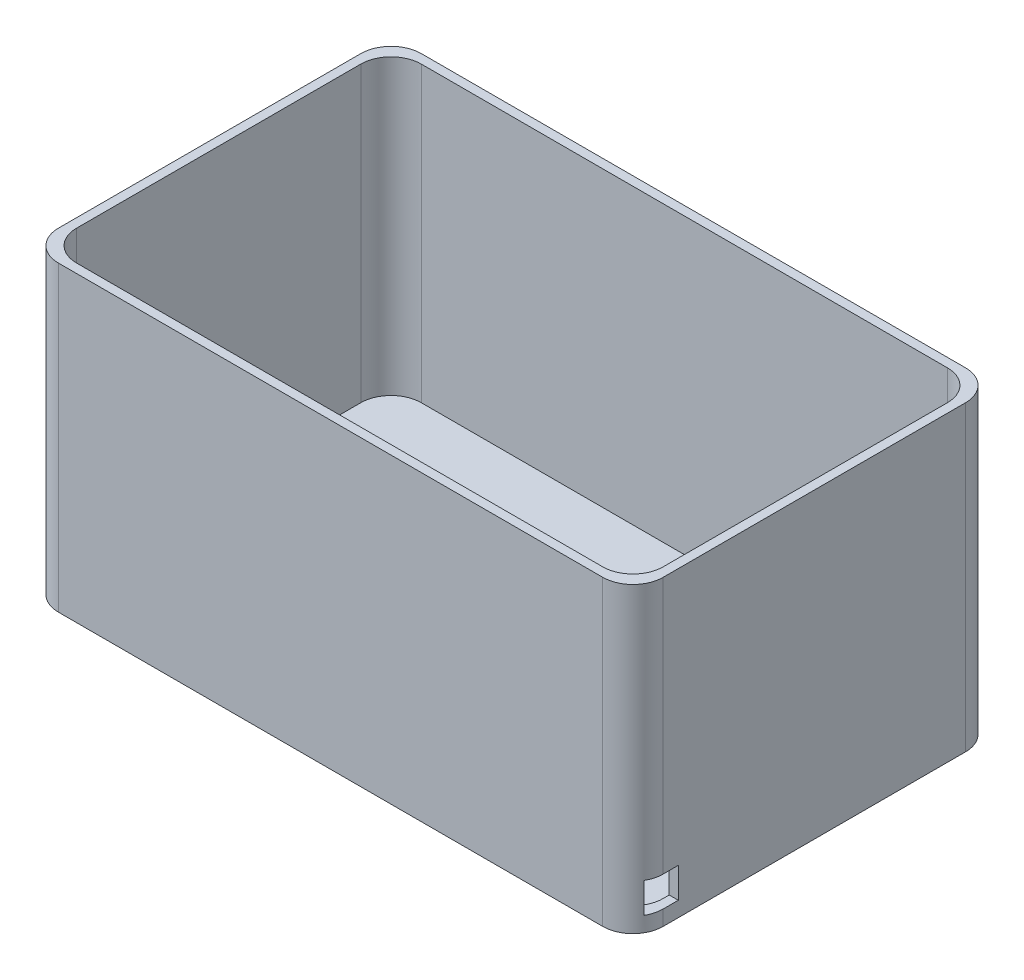
ISO-10303-21;
HEADER;
FILE_DESCRIPTION(('STEP AP214'),'2;1');
FILE_NAME('part.step','',(''),(''),'','','');
FILE_SCHEMA(('AUTOMOTIVE_DESIGN { 1 0 10303 214 1 1 1 1 }'));
ENDSEC;
DATA;
#1=APPLICATION_CONTEXT('core data for automotive mechanical design processes');
#2=APPLICATION_PROTOCOL_DEFINITION('international standard','automotive_design',2000,#1);
#3=PRODUCT_CONTEXT('',#1,'mechanical');
#4=PRODUCT('Part','Part','',(#3));
#5=PRODUCT_RELATED_PRODUCT_CATEGORY('part','',(#4));
#6=PRODUCT_DEFINITION_FORMATION('','',#4);
#7=PRODUCT_DEFINITION_CONTEXT('part definition',#1,'design');
#8=PRODUCT_DEFINITION('design','',#6,#7);
#9=PRODUCT_DEFINITION_SHAPE('','',#8);
#10=(LENGTH_UNIT() NAMED_UNIT(*) SI_UNIT(.MILLI.,.METRE.));
#11=(NAMED_UNIT(*) PLANE_ANGLE_UNIT() SI_UNIT($,.RADIAN.));
#12=(NAMED_UNIT(*) SI_UNIT($,.STERADIAN.) SOLID_ANGLE_UNIT());
#13=UNCERTAINTY_MEASURE_WITH_UNIT(LENGTH_MEASURE(1.E-05),#10,'distance_accuracy_value','');
#14=(GEOMETRIC_REPRESENTATION_CONTEXT(3) GLOBAL_UNCERTAINTY_ASSIGNED_CONTEXT((#13)) GLOBAL_UNIT_ASSIGNED_CONTEXT((#10,
#11,#12)) REPRESENTATION_CONTEXT('',''));
#15=CARTESIAN_POINT('',(0.,0.,0.));
#16=DIRECTION('',(0.,0.,1.));
#17=DIRECTION('',(1.,0.,0.));
#18=AXIS2_PLACEMENT_3D('',#15,#16,#17);
#19=CARTESIAN_POINT('',(100.,100.,-60.));
#20=DIRECTION('',(1.,0.,0.));
#21=DIRECTION('',(0.,0.,-1.));
#22=AXIS2_PLACEMENT_3D('',#19,#20,#21);
#23=PLANE('',#22);
#24=DIRECTION('',(0.,0.,1.));
#25=VECTOR('',#24,1.);
#26=CARTESIAN_POINT('',(100.,100.,-60.));
#27=LINE('',#26,#25);
#28=CARTESIAN_POINT('',(100.,100.,-50.));
#29=VERTEX_POINT('',#28);
#30=CARTESIAN_POINT('',(100.,100.,50.));
#31=VERTEX_POINT('',#30);
#32=EDGE_CURVE('E275',#29,#31,#27,.T.);
#33=ORIENTED_EDGE('',*,*,#32,.T.);
#34=DIRECTION('',(0.,-1.,0.));
#35=VECTOR('',#34,1.);
#36=CARTESIAN_POINT('',(100.,0.,50.));
#37=LINE('',#36,#35);
#38=CARTESIAN_POINT('',(100.,15.,50.));
#39=VERTEX_POINT('',#38);
#40=EDGE_CURVE('E348',#31,#39,#37,.T.);
#41=ORIENTED_EDGE('',*,*,#40,.T.);
#42=DIRECTION('',(0.,0.,-1.));
#43=VECTOR('',#42,1.);
#44=CARTESIAN_POINT('',(100.,15.,-60.));
#45=LINE('',#44,#43);
#46=CARTESIAN_POINT('',(100.,15.,45.));
#47=VERTEX_POINT('',#46);
#48=EDGE_CURVE('E226',#39,#47,#45,.T.);
#49=ORIENTED_EDGE('',*,*,#48,.T.);
#50=DIRECTION('',(0.,-1.,0.));
#51=VECTOR('',#50,1.);
#52=CARTESIAN_POINT('',(100.,100.,45.));
#53=LINE('',#52,#51);
#54=CARTESIAN_POINT('',(100.,5.,45.));
#55=VERTEX_POINT('',#54);
#56=EDGE_CURVE('E229',#47,#55,#53,.T.);
#57=ORIENTED_EDGE('',*,*,#56,.T.);
#58=DIRECTION('',(0.,0.,1.));
#59=VECTOR('',#58,1.);
#60=CARTESIAN_POINT('',(100.,5.,-60.));
#61=LINE('',#60,#59);
#62=CARTESIAN_POINT('',(100.,5.,50.));
#63=VERTEX_POINT('',#62);
#64=EDGE_CURVE('E194',#55,#63,#61,.T.);
#65=ORIENTED_EDGE('',*,*,#64,.T.);
#66=DIRECTION('',(0.,-1.,0.));
#67=VECTOR('',#66,1.);
#68=CARTESIAN_POINT('',(100.,0.,50.));
#69=LINE('',#68,#67);
#70=CARTESIAN_POINT('',(100.,0.,50.));
#71=VERTEX_POINT('',#70);
#72=EDGE_CURVE('E345',#63,#71,#69,.T.);
#73=ORIENTED_EDGE('',*,*,#72,.T.);
#74=DIRECTION('',(0.,0.,1.));
#75=VECTOR('',#74,1.);
#76=CARTESIAN_POINT('',(100.,0.,-60.));
#77=LINE('',#76,#75);
#78=CARTESIAN_POINT('',(100.,0.,-50.));
#79=VERTEX_POINT('',#78);
#80=EDGE_CURVE('E291',#79,#71,#77,.T.);
#81=ORIENTED_EDGE('',*,*,#80,.F.);
#82=DIRECTION('',(0.,-1.,0.));
#83=VECTOR('',#82,1.);
#84=CARTESIAN_POINT('',(100.,100.,-50.));
#85=LINE('',#84,#83);
#86=EDGE_CURVE('E342',#79,#29,#85,.F.);
#87=ORIENTED_EDGE('',*,*,#86,.T.);
#88=EDGE_LOOP('',(#33,#41,#49,#57,#65,#73,#81,#87));
#89=FACE_BOUND('',#88,.T.);
#90=ADVANCED_FACE('F38',(#89),#23,.T.);
#91=CARTESIAN_POINT('',(97.,100.,-60.));
#92=DIRECTION('',(1.,0.,0.));
#93=DIRECTION('',(0.,0.,-1.));
#94=AXIS2_PLACEMENT_3D('',#91,#92,#93);
#95=PLANE('',#94);
#96=DIRECTION('',(0.,0.,1.));
#97=VECTOR('',#96,1.);
#98=CARTESIAN_POINT('',(97.,3.,-60.));
#99=LINE('',#98,#97);
#100=CARTESIAN_POINT('',(97.,3.,-47.));
#101=VERTEX_POINT('',#100);
#102=CARTESIAN_POINT('',(97.,3.,47.));
#103=VERTEX_POINT('',#102);
#104=EDGE_CURVE('E242',#101,#103,#99,.T.);
#105=ORIENTED_EDGE('',*,*,#104,.T.);
#106=DIRECTION('',(0.,-1.,0.));
#107=VECTOR('',#106,1.);
#108=CARTESIAN_POINT('',(97.,100.,47.));
#109=LINE('',#108,#107);
#110=CARTESIAN_POINT('',(97.,5.,47.));
#111=VERTEX_POINT('',#110);
#112=EDGE_CURVE('E214',#103,#111,#109,.F.);
#113=ORIENTED_EDGE('',*,*,#112,.T.);
#114=DIRECTION('',(0.,0.,1.));
#115=VECTOR('',#114,1.);
#116=CARTESIAN_POINT('',(97.,5.,55.));
#117=LINE('',#116,#115);
#118=CARTESIAN_POINT('',(97.,5.,45.));
#119=VERTEX_POINT('',#118);
#120=EDGE_CURVE('E191',#119,#111,#117,.T.);
#121=ORIENTED_EDGE('',*,*,#120,.F.);
#122=DIRECTION('',(0.,-1.,0.));
#123=VECTOR('',#122,1.);
#124=CARTESIAN_POINT('',(97.,15.,45.));
#125=LINE('',#124,#123);
#126=CARTESIAN_POINT('',(97.,15.,45.));
#127=VERTEX_POINT('',#126);
#128=EDGE_CURVE('E203',#127,#119,#125,.T.);
#129=ORIENTED_EDGE('',*,*,#128,.F.);
#130=DIRECTION('',(0.,0.,-1.));
#131=VECTOR('',#130,1.);
#132=CARTESIAN_POINT('',(97.,15.,55.));
#133=LINE('',#132,#131);
#134=CARTESIAN_POINT('',(97.,15.,47.));
#135=VERTEX_POINT('',#134);
#136=EDGE_CURVE('E209',#135,#127,#133,.T.);
#137=ORIENTED_EDGE('',*,*,#136,.F.);
#138=DIRECTION('',(0.,-1.,0.));
#139=VECTOR('',#138,1.);
#140=CARTESIAN_POINT('',(97.,100.,47.));
#141=LINE('',#140,#139);
#142=CARTESIAN_POINT('',(97.,100.,47.));
#143=VERTEX_POINT('',#142);
#144=EDGE_CURVE('E398',#135,#143,#141,.F.);
#145=ORIENTED_EDGE('',*,*,#144,.T.);
#146=DIRECTION('',(0.,0.,1.));
#147=VECTOR('',#146,1.);
#148=CARTESIAN_POINT('',(97.,100.,-60.));
#149=LINE('',#148,#147);
#150=CARTESIAN_POINT('',(97.,100.,-47.));
#151=VERTEX_POINT('',#150);
#152=EDGE_CURVE('E257',#151,#143,#149,.T.);
#153=ORIENTED_EDGE('',*,*,#152,.F.);
#154=DIRECTION('',(0.,-1.,0.));
#155=VECTOR('',#154,1.);
#156=CARTESIAN_POINT('',(97.,3.,-47.));
#157=LINE('',#156,#155);
#158=EDGE_CURVE('E394',#151,#101,#157,.T.);
#159=ORIENTED_EDGE('',*,*,#158,.T.);
#160=EDGE_LOOP('',(#105,#113,#121,#129,#137,#145,#153,#159));
#161=FACE_BOUND('',#160,.T.);
#162=ADVANCED_FACE('F212',(#161),#95,.F.);
#163=CARTESIAN_POINT('',(-100.,100.,-60.));
#164=DIRECTION('',(1.,0.,0.));
#165=DIRECTION('',(0.,0.,-1.));
#166=AXIS2_PLACEMENT_3D('',#163,#164,#165);
#167=PLANE('',#166);
#168=DIRECTION('',(0.,0.,1.));
#169=VECTOR('',#168,1.);
#170=CARTESIAN_POINT('',(-100.,100.,-60.));
#171=LINE('',#170,#169);
#172=CARTESIAN_POINT('',(-100.,100.,-50.));
#173=VERTEX_POINT('',#172);
#174=CARTESIAN_POINT('',(-100.,100.,50.));
#175=VERTEX_POINT('',#174);
#176=EDGE_CURVE('E266',#173,#175,#171,.T.);
#177=ORIENTED_EDGE('',*,*,#176,.F.);
#178=DIRECTION('',(0.,-1.,0.));
#179=VECTOR('',#178,1.);
#180=CARTESIAN_POINT('',(-100.,0.,-50.));
#181=LINE('',#180,#179);
#182=CARTESIAN_POINT('',(-100.,0.,-50.));
#183=VERTEX_POINT('',#182);
#184=EDGE_CURVE('E300',#173,#183,#181,.T.);
#185=ORIENTED_EDGE('',*,*,#184,.T.);
#186=DIRECTION('',(0.,0.,1.));
#187=VECTOR('',#186,1.);
#188=CARTESIAN_POINT('',(-100.,0.,-60.));
#189=LINE('',#188,#187);
#190=CARTESIAN_POINT('',(-100.,0.,50.));
#191=VERTEX_POINT('',#190);
#192=EDGE_CURVE('E265',#183,#191,#189,.T.);
#193=ORIENTED_EDGE('',*,*,#192,.T.);
#194=DIRECTION('',(0.,-1.,0.));
#195=VECTOR('',#194,1.);
#196=CARTESIAN_POINT('',(-100.,100.,50.));
#197=LINE('',#196,#195);
#198=EDGE_CURVE('E283',#191,#175,#197,.F.);
#199=ORIENTED_EDGE('',*,*,#198,.T.);
#200=EDGE_LOOP('',(#177,#185,#193,#199));
#201=FACE_BOUND('',#200,.T.);
#202=ADVANCED_FACE('F489',(#201),#167,.F.);
#203=CARTESIAN_POINT('',(-100.,100.,60.));
#204=DIRECTION('',(0.,0.,-1.));
#205=DIRECTION('',(-1.,0.,0.));
#206=AXIS2_PLACEMENT_3D('',#203,#204,#205);
#207=PLANE('',#206);
#208=DIRECTION('',(1.,0.,0.));
#209=VECTOR('',#208,1.);
#210=CARTESIAN_POINT('',(-100.,100.,60.));
#211=LINE('',#210,#209);
#212=CARTESIAN_POINT('',(-90.,100.,60.));
#213=VERTEX_POINT('',#212);
#214=CARTESIAN_POINT('',(90.,100.,60.));
#215=VERTEX_POINT('',#214);
#216=EDGE_CURVE('E270',#213,#215,#211,.T.);
#217=ORIENTED_EDGE('',*,*,#216,.F.);
#218=DIRECTION('',(0.,-1.,0.));
#219=VECTOR('',#218,1.);
#220=CARTESIAN_POINT('',(-90.,100.,60.));
#221=LINE('',#220,#219);
#222=CARTESIAN_POINT('',(-90.,0.,60.));
#223=VERTEX_POINT('',#222);
#224=EDGE_CURVE('E338',#213,#223,#221,.T.);
#225=ORIENTED_EDGE('',*,*,#224,.T.);
#226=DIRECTION('',(1.,0.,0.));
#227=VECTOR('',#226,1.);
#228=CARTESIAN_POINT('',(-100.,0.,60.));
#229=LINE('',#228,#227);
#230=CARTESIAN_POINT('',(90.,0.,60.));
#231=VERTEX_POINT('',#230);
#232=EDGE_CURVE('E287',#223,#231,#229,.T.);
#233=ORIENTED_EDGE('',*,*,#232,.T.);
#234=DIRECTION('',(0.,-1.,0.));
#235=VECTOR('',#234,1.);
#236=CARTESIAN_POINT('',(90.,100.,60.));
#237=LINE('',#236,#235);
#238=EDGE_CURVE('E335',#231,#215,#237,.F.);
#239=ORIENTED_EDGE('',*,*,#238,.T.);
#240=EDGE_LOOP('',(#217,#225,#233,#239));
#241=FACE_BOUND('',#240,.T.);
#242=ADVANCED_FACE('F497',(#241),#207,.F.);
#243=CARTESIAN_POINT('',(-100.,100.,-60.));
#244=DIRECTION('',(0.,0.,-1.));
#245=DIRECTION('',(-1.,0.,0.));
#246=AXIS2_PLACEMENT_3D('',#243,#244,#245);
#247=PLANE('',#246);
#248=DIRECTION('',(1.,0.,0.));
#249=VECTOR('',#248,1.);
#250=CARTESIAN_POINT('',(-100.,0.,-60.));
#251=LINE('',#250,#249);
#252=CARTESIAN_POINT('',(-90.,0.,-60.));
#253=VERTEX_POINT('',#252);
#254=CARTESIAN_POINT('',(90.,0.,-60.));
#255=VERTEX_POINT('',#254);
#256=EDGE_CURVE('E271',#253,#255,#251,.T.);
#257=ORIENTED_EDGE('',*,*,#256,.F.);
#258=DIRECTION('',(0.,-1.,0.));
#259=VECTOR('',#258,1.);
#260=CARTESIAN_POINT('',(-90.,100.,-60.));
#261=LINE('',#260,#259);
#262=CARTESIAN_POINT('',(-90.,100.,-60.));
#263=VERTEX_POINT('',#262);
#264=EDGE_CURVE('E320',#253,#263,#261,.F.);
#265=ORIENTED_EDGE('',*,*,#264,.T.);
#266=DIRECTION('',(1.,0.,0.));
#267=VECTOR('',#266,1.);
#268=CARTESIAN_POINT('',(-100.,100.,-60.));
#269=LINE('',#268,#267);
#270=CARTESIAN_POINT('',(90.,100.,-60.));
#271=VERTEX_POINT('',#270);
#272=EDGE_CURVE('E279',#263,#271,#269,.T.);
#273=ORIENTED_EDGE('',*,*,#272,.T.);
#274=DIRECTION('',(0.,-1.,0.));
#275=VECTOR('',#274,1.);
#276=CARTESIAN_POINT('',(90.,100.,-60.));
#277=LINE('',#276,#275);
#278=EDGE_CURVE('E316',#271,#255,#277,.T.);
#279=ORIENTED_EDGE('',*,*,#278,.T.);
#280=EDGE_LOOP('',(#257,#265,#273,#279));
#281=FACE_BOUND('',#280,.T.);
#282=ADVANCED_FACE('F479',(#281),#247,.T.);
#283=CARTESIAN_POINT('',(0.,100.,0.));
#284=DIRECTION('',(0.,1.,0.));
#285=DIRECTION('',(0.,0.,1.));
#286=AXIS2_PLACEMENT_3D('',#283,#284,#285);
#287=PLANE('',#286);
#288=DIRECTION('',(0.,0.,1.));
#289=VECTOR('',#288,1.);
#290=CARTESIAN_POINT('',(-97.,100.,-60.));
#291=LINE('',#290,#289);
#292=CARTESIAN_POINT('',(-97.,100.,-47.));
#293=VERTEX_POINT('',#292);
#294=CARTESIAN_POINT('',(-97.,100.,47.));
#295=VERTEX_POINT('',#294);
#296=EDGE_CURVE('E249',#293,#295,#291,.T.);
#297=ORIENTED_EDGE('',*,*,#296,.F.);
#298=CARTESIAN_POINT('',(-87.,100.,-47.));
#299=DIRECTION('',(0.,1.,0.));
#300=DIRECTION('',(0.,0.,1.));
#301=AXIS2_PLACEMENT_3D('',#298,#299,#300);
#302=CIRCLE('',#301,10.);
#303=CARTESIAN_POINT('',(-87.,100.,-57.));
#304=VERTEX_POINT('',#303);
#305=EDGE_CURVE('E403',#293,#304,#302,.F.);
#306=ORIENTED_EDGE('',*,*,#305,.T.);
#307=DIRECTION('',(1.,0.,0.));
#308=VECTOR('',#307,1.);
#309=CARTESIAN_POINT('',(-100.,100.,-57.));
#310=LINE('',#309,#308);
#311=CARTESIAN_POINT('',(87.,100.,-57.));
#312=VERTEX_POINT('',#311);
#313=EDGE_CURVE('E261',#304,#312,#310,.T.);
#314=ORIENTED_EDGE('',*,*,#313,.T.);
#315=CARTESIAN_POINT('',(87.,100.,-47.));
#316=DIRECTION('',(0.,1.,0.));
#317=DIRECTION('',(0.,0.,1.));
#318=AXIS2_PLACEMENT_3D('',#315,#316,#317);
#319=CIRCLE('',#318,10.);
#320=EDGE_CURVE('E47',#312,#151,#319,.F.);
#321=ORIENTED_EDGE('',*,*,#320,.T.);
#322=ORIENTED_EDGE('',*,*,#152,.T.);
#323=CARTESIAN_POINT('',(87.,100.,47.));
#324=DIRECTION('',(0.,1.,0.));
#325=DIRECTION('',(0.,0.,1.));
#326=AXIS2_PLACEMENT_3D('',#323,#324,#325);
#327=CIRCLE('',#326,10.);
#328=CARTESIAN_POINT('',(87.,100.,57.));
#329=VERTEX_POINT('',#328);
#330=EDGE_CURVE('E415',#143,#329,#327,.F.);
#331=ORIENTED_EDGE('',*,*,#330,.T.);
#332=DIRECTION('',(1.,0.,0.));
#333=VECTOR('',#332,1.);
#334=CARTESIAN_POINT('',(-100.,100.,57.));
#335=LINE('',#334,#333);
#336=CARTESIAN_POINT('',(-87.,100.,57.));
#337=VERTEX_POINT('',#336);
#338=EDGE_CURVE('E253',#337,#329,#335,.T.);
#339=ORIENTED_EDGE('',*,*,#338,.F.);
#340=CARTESIAN_POINT('',(-87.,100.,47.));
#341=DIRECTION('',(0.,1.,0.));
#342=DIRECTION('',(0.,0.,1.));
#343=AXIS2_PLACEMENT_3D('',#340,#341,#342);
#344=CIRCLE('',#343,10.);
#345=EDGE_CURVE('E11',#337,#295,#344,.F.);
#346=ORIENTED_EDGE('',*,*,#345,.T.);
#347=EDGE_LOOP('',(#297,#306,#314,#321,#322,#331,#339,#346));
#348=FACE_BOUND('',#347,.T.);
#349=ORIENTED_EDGE('',*,*,#272,.F.);
#350=CARTESIAN_POINT('',(-90.,100.,-50.));
#351=DIRECTION('',(0.,1.,0.));
#352=DIRECTION('',(0.,0.,1.));
#353=AXIS2_PLACEMENT_3D('',#350,#351,#352);
#354=CIRCLE('',#353,10.);
#355=EDGE_CURVE('E332',#263,#173,#354,.T.);
#356=ORIENTED_EDGE('',*,*,#355,.T.);
#357=ORIENTED_EDGE('',*,*,#176,.T.);
#358=CARTESIAN_POINT('',(-90.,100.,50.));
#359=DIRECTION('',(0.,1.,0.));
#360=DIRECTION('',(0.,0.,1.));
#361=AXIS2_PLACEMENT_3D('',#358,#359,#360);
#362=CIRCLE('',#361,10.);
#363=EDGE_CURVE('E329',#175,#213,#362,.T.);
#364=ORIENTED_EDGE('',*,*,#363,.T.);
#365=ORIENTED_EDGE('',*,*,#216,.T.);
#366=CARTESIAN_POINT('',(90.,100.,50.));
#367=DIRECTION('',(0.,1.,0.));
#368=DIRECTION('',(0.,0.,1.));
#369=AXIS2_PLACEMENT_3D('',#366,#367,#368);
#370=CIRCLE('',#369,10.);
#371=EDGE_CURVE('E326',#215,#31,#370,.T.);
#372=ORIENTED_EDGE('',*,*,#371,.T.);
#373=ORIENTED_EDGE('',*,*,#32,.F.);
#374=CARTESIAN_POINT('',(90.,100.,-50.));
#375=DIRECTION('',(0.,1.,0.));
#376=DIRECTION('',(0.,0.,1.));
#377=AXIS2_PLACEMENT_3D('',#374,#375,#376);
#378=CIRCLE('',#377,10.);
#379=EDGE_CURVE('E323',#29,#271,#378,.T.);
#380=ORIENTED_EDGE('',*,*,#379,.T.);
#381=EDGE_LOOP('',(#349,#356,#357,#364,#365,#372,#373,#380));
#382=FACE_BOUND('',#381,.T.);
#383=ADVANCED_FACE('F422',(#348,#382),#287,.T.);
#384=CARTESIAN_POINT('',(0.,0.,0.));
#385=DIRECTION('',(0.,1.,0.));
#386=DIRECTION('',(0.,0.,1.));
#387=AXIS2_PLACEMENT_3D('',#384,#385,#386);
#388=PLANE('',#387);
#389=ORIENTED_EDGE('',*,*,#192,.F.);
#390=CARTESIAN_POINT('',(-90.,0.,-50.));
#391=DIRECTION('',(0.,1.,0.));
#392=DIRECTION('',(0.,0.,1.));
#393=AXIS2_PLACEMENT_3D('',#390,#391,#392);
#394=CIRCLE('',#393,10.);
#395=EDGE_CURVE('E313',#183,#253,#394,.F.);
#396=ORIENTED_EDGE('',*,*,#395,.T.);
#397=ORIENTED_EDGE('',*,*,#256,.T.);
#398=CARTESIAN_POINT('',(90.,0.,-50.));
#399=DIRECTION('',(0.,1.,0.));
#400=DIRECTION('',(0.,0.,1.));
#401=AXIS2_PLACEMENT_3D('',#398,#399,#400);
#402=CIRCLE('',#401,10.);
#403=EDGE_CURVE('E304',#255,#79,#402,.F.);
#404=ORIENTED_EDGE('',*,*,#403,.T.);
#405=ORIENTED_EDGE('',*,*,#80,.T.);
#406=CARTESIAN_POINT('',(90.,0.,50.));
#407=DIRECTION('',(0.,1.,0.));
#408=DIRECTION('',(0.,0.,1.));
#409=AXIS2_PLACEMENT_3D('',#406,#407,#408);
#410=CIRCLE('',#409,10.);
#411=EDGE_CURVE('E307',#71,#231,#410,.F.);
#412=ORIENTED_EDGE('',*,*,#411,.T.);
#413=ORIENTED_EDGE('',*,*,#232,.F.);
#414=CARTESIAN_POINT('',(-90.,0.,50.));
#415=DIRECTION('',(0.,1.,0.));
#416=DIRECTION('',(0.,0.,1.));
#417=AXIS2_PLACEMENT_3D('',#414,#415,#416);
#418=CIRCLE('',#417,10.);
#419=EDGE_CURVE('E310',#223,#191,#418,.F.);
#420=ORIENTED_EDGE('',*,*,#419,.T.);
#421=EDGE_LOOP('',(#389,#396,#397,#404,#405,#412,#413,#420));
#422=FACE_BOUND('',#421,.T.);
#423=ADVANCED_FACE('F471',(#422),#388,.F.);
#424=CARTESIAN_POINT('',(-97.,100.,-60.));
#425=DIRECTION('',(1.,0.,0.));
#426=DIRECTION('',(0.,0.,-1.));
#427=AXIS2_PLACEMENT_3D('',#424,#425,#426);
#428=PLANE('',#427);
#429=DIRECTION('',(0.,0.,1.));
#430=VECTOR('',#429,1.);
#431=CARTESIAN_POINT('',(-97.,3.,-60.));
#432=LINE('',#431,#430);
#433=CARTESIAN_POINT('',(-97.,3.,-47.));
#434=VERTEX_POINT('',#433);
#435=CARTESIAN_POINT('',(-97.,3.,47.));
#436=VERTEX_POINT('',#435);
#437=EDGE_CURVE('E234',#434,#436,#432,.T.);
#438=ORIENTED_EDGE('',*,*,#437,.F.);
#439=DIRECTION('',(0.,-1.,0.));
#440=VECTOR('',#439,1.);
#441=CARTESIAN_POINT('',(-97.,100.,-47.));
#442=LINE('',#441,#440);
#443=EDGE_CURVE('E384',#434,#293,#442,.F.);
#444=ORIENTED_EDGE('',*,*,#443,.T.);
#445=ORIENTED_EDGE('',*,*,#296,.T.);
#446=DIRECTION('',(0.,-1.,0.));
#447=VECTOR('',#446,1.);
#448=CARTESIAN_POINT('',(-97.,3.,47.));
#449=LINE('',#448,#447);
#450=EDGE_CURVE('E380',#295,#436,#449,.T.);
#451=ORIENTED_EDGE('',*,*,#450,.T.);
#452=EDGE_LOOP('',(#438,#444,#445,#451));
#453=FACE_BOUND('',#452,.T.);
#454=ADVANCED_FACE('F444',(#453),#428,.T.);
#455=CARTESIAN_POINT('',(-100.,100.,57.));
#456=DIRECTION('',(0.,0.,-1.));
#457=DIRECTION('',(-1.,0.,0.));
#458=AXIS2_PLACEMENT_3D('',#455,#456,#457);
#459=PLANE('',#458);
#460=ORIENTED_EDGE('',*,*,#338,.T.);
#461=DIRECTION('',(0.,-1.,0.));
#462=VECTOR('',#461,1.);
#463=CARTESIAN_POINT('',(87.,100.,57.));
#464=LINE('',#463,#462);
#465=CARTESIAN_POINT('',(87.,3.,57.));
#466=VERTEX_POINT('',#465);
#467=EDGE_CURVE('E390',#329,#466,#464,.T.);
#468=ORIENTED_EDGE('',*,*,#467,.T.);
#469=DIRECTION('',(1.,0.,0.));
#470=VECTOR('',#469,1.);
#471=CARTESIAN_POINT('',(-100.,3.,57.));
#472=LINE('',#471,#470);
#473=CARTESIAN_POINT('',(-87.,3.,57.));
#474=VERTEX_POINT('',#473);
#475=EDGE_CURVE('E238',#474,#466,#472,.T.);
#476=ORIENTED_EDGE('',*,*,#475,.F.);
#477=DIRECTION('',(0.,-1.,0.));
#478=VECTOR('',#477,1.);
#479=CARTESIAN_POINT('',(-87.,100.,57.));
#480=LINE('',#479,#478);
#481=EDGE_CURVE('E387',#474,#337,#480,.F.);
#482=ORIENTED_EDGE('',*,*,#481,.T.);
#483=EDGE_LOOP('',(#460,#468,#476,#482));
#484=FACE_BOUND('',#483,.T.);
#485=ADVANCED_FACE('F451',(#484),#459,.T.);
#486=CARTESIAN_POINT('',(-100.,100.,-57.));
#487=DIRECTION('',(0.,0.,-1.));
#488=DIRECTION('',(-1.,0.,0.));
#489=AXIS2_PLACEMENT_3D('',#486,#487,#488);
#490=PLANE('',#489);
#491=ORIENTED_EDGE('',*,*,#313,.F.);
#492=DIRECTION('',(0.,-1.,0.));
#493=VECTOR('',#492,1.);
#494=CARTESIAN_POINT('',(-87.,100.,-57.));
#495=LINE('',#494,#493);
#496=CARTESIAN_POINT('',(-87.,3.,-57.));
#497=VERTEX_POINT('',#496);
#498=EDGE_CURVE('E364',#304,#497,#495,.T.);
#499=ORIENTED_EDGE('',*,*,#498,.T.);
#500=DIRECTION('',(1.,0.,0.));
#501=VECTOR('',#500,1.);
#502=CARTESIAN_POINT('',(-100.,3.,-57.));
#503=LINE('',#502,#501);
#504=CARTESIAN_POINT('',(87.,3.,-57.));
#505=VERTEX_POINT('',#504);
#506=EDGE_CURVE('E245',#497,#505,#503,.T.);
#507=ORIENTED_EDGE('',*,*,#506,.T.);
#508=DIRECTION('',(0.,-1.,0.));
#509=VECTOR('',#508,1.);
#510=CARTESIAN_POINT('',(87.,100.,-57.));
#511=LINE('',#510,#509);
#512=EDGE_CURVE('E361',#505,#312,#511,.F.);
#513=ORIENTED_EDGE('',*,*,#512,.T.);
#514=EDGE_LOOP('',(#491,#499,#507,#513));
#515=FACE_BOUND('',#514,.T.);
#516=ADVANCED_FACE('F436',(#515),#490,.F.);
#517=CARTESIAN_POINT('',(0.,3.,0.));
#518=DIRECTION('',(0.,1.,0.));
#519=DIRECTION('',(0.,0.,1.));
#520=AXIS2_PLACEMENT_3D('',#517,#518,#519);
#521=PLANE('',#520);
#522=ORIENTED_EDGE('',*,*,#506,.F.);
#523=CARTESIAN_POINT('',(-87.,3.,-47.));
#524=DIRECTION('',(0.,1.,0.));
#525=DIRECTION('',(0.,0.,1.));
#526=AXIS2_PLACEMENT_3D('',#523,#524,#525);
#527=CIRCLE('',#526,10.);
#528=EDGE_CURVE('E377',#497,#434,#527,.T.);
#529=ORIENTED_EDGE('',*,*,#528,.T.);
#530=ORIENTED_EDGE('',*,*,#437,.T.);
#531=CARTESIAN_POINT('',(-87.,3.,47.));
#532=DIRECTION('',(0.,1.,0.));
#533=DIRECTION('',(0.,0.,1.));
#534=AXIS2_PLACEMENT_3D('',#531,#532,#533);
#535=CIRCLE('',#534,10.);
#536=EDGE_CURVE('E368',#436,#474,#535,.T.);
#537=ORIENTED_EDGE('',*,*,#536,.T.);
#538=ORIENTED_EDGE('',*,*,#475,.T.);
#539=CARTESIAN_POINT('',(87.,3.,47.));
#540=DIRECTION('',(0.,1.,0.));
#541=DIRECTION('',(0.,0.,1.));
#542=AXIS2_PLACEMENT_3D('',#539,#540,#541);
#543=CIRCLE('',#542,10.);
#544=EDGE_CURVE('E374',#466,#103,#543,.T.);
#545=ORIENTED_EDGE('',*,*,#544,.T.);
#546=ORIENTED_EDGE('',*,*,#104,.F.);
#547=CARTESIAN_POINT('',(87.,3.,-47.));
#548=DIRECTION('',(0.,1.,0.));
#549=DIRECTION('',(0.,0.,1.));
#550=AXIS2_PLACEMENT_3D('',#547,#548,#549);
#551=CIRCLE('',#550,10.);
#552=EDGE_CURVE('E371',#101,#505,#551,.T.);
#553=ORIENTED_EDGE('',*,*,#552,.T.);
#554=EDGE_LOOP('',(#522,#529,#530,#537,#538,#545,#546,#553));
#555=FACE_BOUND('',#554,.T.);
#556=ADVANCED_FACE('F434',(#555),#521,.T.);
#557=CARTESIAN_POINT('',(100.000012,15.,55.));
#558=DIRECTION('',(0.,0.,-1.));
#559=DIRECTION('',(-1.,0.,0.));
#560=AXIS2_PLACEMENT_3D('',#557,#558,#559);
#561=PLANE('',#560);
#562=DIRECTION('',(-1.,0.,0.));
#563=VECTOR('',#562,1.);
#564=CARTESIAN_POINT('',(100.000012,15.,55.));
#565=LINE('',#564,#563);
#566=CARTESIAN_POINT('',(98.6602540378444,15.,55.));
#567=VERTEX_POINT('',#566);
#568=CARTESIAN_POINT('',(93.,15.,55.));
#569=VERTEX_POINT('',#568);
#570=EDGE_CURVE('E54',#567,#569,#565,.T.);
#571=ORIENTED_EDGE('',*,*,#570,.F.);
#572=DIRECTION('',(0.,1.,0.));
#573=VECTOR('',#572,1.);
#574=CARTESIAN_POINT('',(98.6602540378444,15.,55.));
#575=LINE('',#574,#573);
#576=CARTESIAN_POINT('',(98.6602540378444,5.,55.));
#577=VERTEX_POINT('',#576);
#578=EDGE_CURVE('E355',#567,#577,#575,.F.);
#579=ORIENTED_EDGE('',*,*,#578,.T.);
#580=DIRECTION('',(-1.,0.,0.));
#581=VECTOR('',#580,1.);
#582=CARTESIAN_POINT('',(100.000012,5.,55.));
#583=LINE('',#582,#581);
#584=CARTESIAN_POINT('',(93.,5.,55.));
#585=VERTEX_POINT('',#584);
#586=EDGE_CURVE('E61',#577,#585,#583,.T.);
#587=ORIENTED_EDGE('',*,*,#586,.T.);
#588=DIRECTION('',(0.,-1.,0.));
#589=VECTOR('',#588,1.);
#590=CARTESIAN_POINT('',(93.,5.,55.));
#591=LINE('',#590,#589);
#592=EDGE_CURVE('E409',#585,#569,#591,.F.);
#593=ORIENTED_EDGE('',*,*,#592,.T.);
#594=EDGE_LOOP('',(#571,#579,#587,#593));
#595=FACE_BOUND('',#594,.T.);
#596=ADVANCED_FACE('F501',(#595),#561,.T.);
#597=CARTESIAN_POINT('',(100.000012,5.,55.));
#598=DIRECTION('',(0.,1.,0.));
#599=DIRECTION('',(0.,0.,1.));
#600=AXIS2_PLACEMENT_3D('',#597,#598,#599);
#601=PLANE('',#600);
#602=ORIENTED_EDGE('',*,*,#586,.F.);
#603=CARTESIAN_POINT('',(90.,5.,50.));
#604=DIRECTION('',(0.,1.,0.));
#605=DIRECTION('',(0.,0.,1.));
#606=AXIS2_PLACEMENT_3D('',#603,#604,#605);
#607=CIRCLE('',#606,10.);
#608=EDGE_CURVE('E358',#577,#63,#607,.T.);
#609=ORIENTED_EDGE('',*,*,#608,.T.);
#610=ORIENTED_EDGE('',*,*,#64,.F.);
#611=DIRECTION('',(-1.,0.,0.));
#612=VECTOR('',#611,1.);
#613=CARTESIAN_POINT('',(100.000012,5.,45.));
#614=LINE('',#613,#612);
#615=EDGE_CURVE('E187',#55,#119,#614,.T.);
#616=ORIENTED_EDGE('',*,*,#615,.T.);
#617=ORIENTED_EDGE('',*,*,#120,.T.);
#618=CARTESIAN_POINT('',(87.,5.,47.));
#619=DIRECTION('',(0.,1.,0.));
#620=DIRECTION('',(0.,0.,1.));
#621=AXIS2_PLACEMENT_3D('',#618,#619,#620);
#622=CIRCLE('',#621,10.);
#623=EDGE_CURVE('E406',#111,#585,#622,.F.);
#624=ORIENTED_EDGE('',*,*,#623,.T.);
#625=EDGE_LOOP('',(#602,#609,#610,#616,#617,#624));
#626=FACE_BOUND('',#625,.T.);
#627=ADVANCED_FACE('F189',(#626),#601,.T.);
#628=CARTESIAN_POINT('',(100.000012,15.,45.));
#629=DIRECTION('',(0.,0.,1.));
#630=DIRECTION('',(1.,0.,0.));
#631=AXIS2_PLACEMENT_3D('',#628,#629,#630);
#632=PLANE('',#631);
#633=DIRECTION('',(-1.,0.,0.));
#634=VECTOR('',#633,1.);
#635=CARTESIAN_POINT('',(100.000012,15.,45.));
#636=LINE('',#635,#634);
#637=EDGE_CURVE('E199',#47,#127,#636,.T.);
#638=ORIENTED_EDGE('',*,*,#637,.T.);
#639=ORIENTED_EDGE('',*,*,#128,.T.);
#640=ORIENTED_EDGE('',*,*,#615,.F.);
#641=ORIENTED_EDGE('',*,*,#56,.F.);
#642=EDGE_LOOP('',(#638,#639,#640,#641));
#643=FACE_BOUND('',#642,.T.);
#644=ADVANCED_FACE('F204',(#643),#632,.T.);
#645=CARTESIAN_POINT('',(100.000012,15.,55.));
#646=DIRECTION('',(0.,-1.,0.));
#647=DIRECTION('',(0.,0.,-1.));
#648=AXIS2_PLACEMENT_3D('',#645,#646,#647);
#649=PLANE('',#648);
#650=ORIENTED_EDGE('',*,*,#48,.F.);
#651=CARTESIAN_POINT('',(90.,15.,50.));
#652=DIRECTION('',(0.,-1.,0.));
#653=DIRECTION('',(0.,0.,-1.));
#654=AXIS2_PLACEMENT_3D('',#651,#652,#653);
#655=CIRCLE('',#654,10.);
#656=EDGE_CURVE('E352',#39,#567,#655,.T.);
#657=ORIENTED_EDGE('',*,*,#656,.T.);
#658=ORIENTED_EDGE('',*,*,#570,.T.);
#659=CARTESIAN_POINT('',(87.,15.,47.));
#660=DIRECTION('',(0.,-1.,0.));
#661=DIRECTION('',(0.,0.,-1.));
#662=AXIS2_PLACEMENT_3D('',#659,#660,#661);
#663=CIRCLE('',#662,10.);
#664=EDGE_CURVE('E412',#569,#135,#663,.F.);
#665=ORIENTED_EDGE('',*,*,#664,.T.);
#666=ORIENTED_EDGE('',*,*,#136,.T.);
#667=ORIENTED_EDGE('',*,*,#637,.F.);
#668=EDGE_LOOP('',(#650,#657,#658,#665,#666,#667));
#669=FACE_BOUND('',#668,.T.);
#670=ADVANCED_FACE('F500',(#669),#649,.T.);
#671=CARTESIAN_POINT('',(-90.,100.,-50.));
#672=DIRECTION('',(0.,1.,0.));
#673=DIRECTION('',(0.,0.,1.));
#674=AXIS2_PLACEMENT_3D('',#671,#672,#673);
#675=CYLINDRICAL_SURFACE('',#674,10.);
#676=ORIENTED_EDGE('',*,*,#355,.F.);
#677=ORIENTED_EDGE('',*,*,#264,.F.);
#678=ORIENTED_EDGE('',*,*,#395,.F.);
#679=ORIENTED_EDGE('',*,*,#184,.F.);
#680=EDGE_LOOP('',(#676,#677,#678,#679));
#681=FACE_BOUND('',#680,.T.);
#682=ADVANCED_FACE('F487',(#681),#675,.T.);
#683=CARTESIAN_POINT('',(-90.,100.,50.));
#684=DIRECTION('',(0.,-1.,0.));
#685=DIRECTION('',(0.,0.,-1.));
#686=AXIS2_PLACEMENT_3D('',#683,#684,#685);
#687=CYLINDRICAL_SURFACE('',#686,10.);
#688=ORIENTED_EDGE('',*,*,#363,.F.);
#689=ORIENTED_EDGE('',*,*,#198,.F.);
#690=ORIENTED_EDGE('',*,*,#419,.F.);
#691=ORIENTED_EDGE('',*,*,#224,.F.);
#692=EDGE_LOOP('',(#688,#689,#690,#691));
#693=FACE_BOUND('',#692,.T.);
#694=ADVANCED_FACE('F494',(#693),#687,.T.);
#695=CARTESIAN_POINT('',(90.,100.,50.));
#696=DIRECTION('',(0.,1.,0.));
#697=DIRECTION('',(0.,0.,1.));
#698=AXIS2_PLACEMENT_3D('',#695,#696,#697);
#699=CYLINDRICAL_SURFACE('',#698,10.);
#700=ORIENTED_EDGE('',*,*,#371,.F.);
#701=ORIENTED_EDGE('',*,*,#238,.F.);
#702=ORIENTED_EDGE('',*,*,#411,.F.);
#703=ORIENTED_EDGE('',*,*,#72,.F.);
#704=ORIENTED_EDGE('',*,*,#608,.F.);
#705=ORIENTED_EDGE('',*,*,#578,.F.);
#706=ORIENTED_EDGE('',*,*,#656,.F.);
#707=ORIENTED_EDGE('',*,*,#40,.F.);
#708=EDGE_LOOP('',(#700,#701,#702,#703,#704,#705,#706,#707));
#709=FACE_BOUND('',#708,.T.);
#710=ADVANCED_FACE('F463',(#709),#699,.T.);
#711=CARTESIAN_POINT('',(90.,100.,-50.));
#712=DIRECTION('',(0.,-1.,0.));
#713=DIRECTION('',(0.,0.,-1.));
#714=AXIS2_PLACEMENT_3D('',#711,#712,#713);
#715=CYLINDRICAL_SURFACE('',#714,10.);
#716=ORIENTED_EDGE('',*,*,#379,.F.);
#717=ORIENTED_EDGE('',*,*,#86,.F.);
#718=ORIENTED_EDGE('',*,*,#403,.F.);
#719=ORIENTED_EDGE('',*,*,#278,.F.);
#720=EDGE_LOOP('',(#716,#717,#718,#719));
#721=FACE_BOUND('',#720,.T.);
#722=ADVANCED_FACE('F477',(#721),#715,.T.);
#723=CARTESIAN_POINT('',(-87.,100.,-47.));
#724=DIRECTION('',(0.,-1.,0.));
#725=DIRECTION('',(0.,0.,-1.));
#726=AXIS2_PLACEMENT_3D('',#723,#724,#725);
#727=CYLINDRICAL_SURFACE('',#726,10.);
#728=ORIENTED_EDGE('',*,*,#305,.F.);
#729=ORIENTED_EDGE('',*,*,#443,.F.);
#730=ORIENTED_EDGE('',*,*,#528,.F.);
#731=ORIENTED_EDGE('',*,*,#498,.F.);
#732=EDGE_LOOP('',(#728,#729,#730,#731));
#733=FACE_BOUND('',#732,.T.);
#734=ADVANCED_FACE('F440',(#733),#727,.F.);
#735=CARTESIAN_POINT('',(87.,100.,47.));
#736=DIRECTION('',(0.,-1.,0.));
#737=DIRECTION('',(0.,0.,-1.));
#738=AXIS2_PLACEMENT_3D('',#735,#736,#737);
#739=CYLINDRICAL_SURFACE('',#738,10.);
#740=ORIENTED_EDGE('',*,*,#623,.F.);
#741=ORIENTED_EDGE('',*,*,#112,.F.);
#742=ORIENTED_EDGE('',*,*,#544,.F.);
#743=ORIENTED_EDGE('',*,*,#467,.F.);
#744=ORIENTED_EDGE('',*,*,#330,.F.);
#745=ORIENTED_EDGE('',*,*,#144,.F.);
#746=ORIENTED_EDGE('',*,*,#664,.F.);
#747=ORIENTED_EDGE('',*,*,#592,.F.);
#748=EDGE_LOOP('',(#740,#741,#742,#743,#744,#745,#746,#747));
#749=FACE_BOUND('',#748,.T.);
#750=ADVANCED_FACE('F455',(#749),#739,.F.);
#751=CARTESIAN_POINT('',(87.,100.,-47.));
#752=DIRECTION('',(0.,1.,0.));
#753=DIRECTION('',(0.,0.,1.));
#754=AXIS2_PLACEMENT_3D('',#751,#752,#753);
#755=CYLINDRICAL_SURFACE('',#754,10.);
#756=ORIENTED_EDGE('',*,*,#320,.F.);
#757=ORIENTED_EDGE('',*,*,#512,.F.);
#758=ORIENTED_EDGE('',*,*,#552,.F.);
#759=ORIENTED_EDGE('',*,*,#158,.F.);
#760=EDGE_LOOP('',(#756,#757,#758,#759));
#761=FACE_BOUND('',#760,.T.);
#762=ADVANCED_FACE('F431',(#761),#755,.F.);
#763=CARTESIAN_POINT('',(-87.,100.,47.));
#764=DIRECTION('',(0.,1.,0.));
#765=DIRECTION('',(0.,0.,1.));
#766=AXIS2_PLACEMENT_3D('',#763,#764,#765);
#767=CYLINDRICAL_SURFACE('',#766,10.);
#768=ORIENTED_EDGE('',*,*,#345,.F.);
#769=ORIENTED_EDGE('',*,*,#481,.F.);
#770=ORIENTED_EDGE('',*,*,#536,.F.);
#771=ORIENTED_EDGE('',*,*,#450,.F.);
#772=EDGE_LOOP('',(#768,#769,#770,#771));
#773=FACE_BOUND('',#772,.T.);
#774=ADVANCED_FACE('F40',(#773),#767,.F.);
#775=CLOSED_SHELL('',(#90,#162,#202,#242,#282,#383,#423,#454,#485,#516,#556,#596,#627,#644,#670,
#682,#694,#710,#722,#734,#750,#762,#774));
#776=MANIFOLD_SOLID_BREP('B2',#775);
#777=ADVANCED_BREP_SHAPE_REPRESENTATION('',(#18,#776),#14);
#778=SHAPE_DEFINITION_REPRESENTATION(#9,#777);
ENDSEC;
END-ISO-10303-21;
